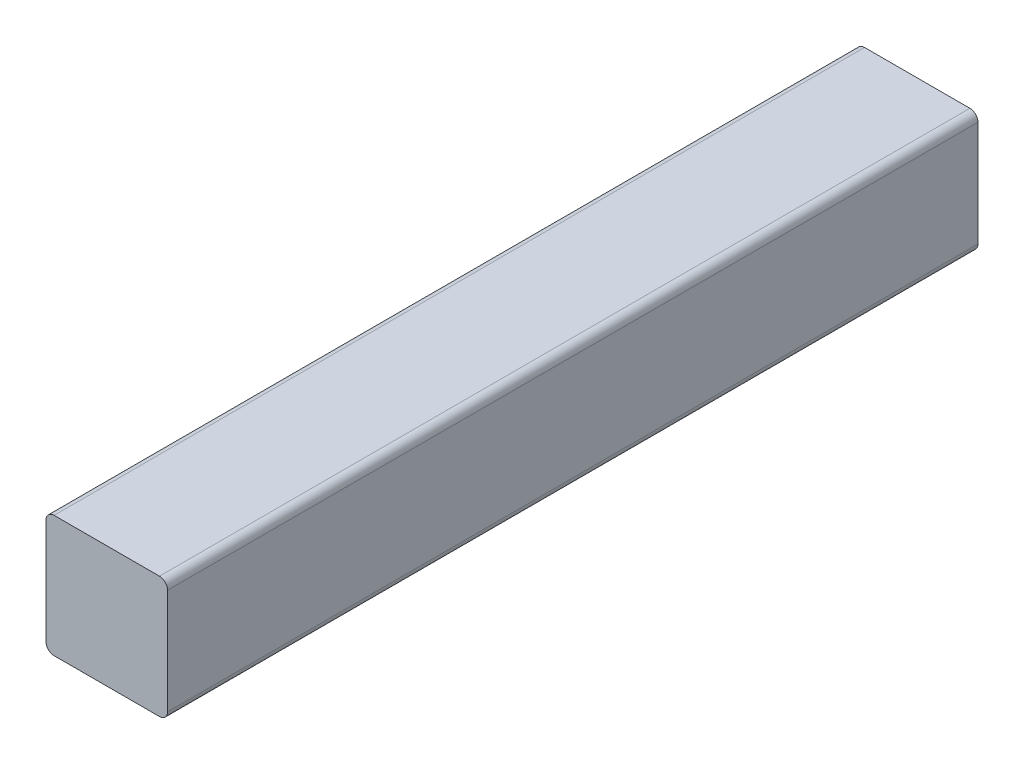
ISO-10303-21;
HEADER;
FILE_DESCRIPTION(('STEP AP214'),'2;1');
FILE_NAME('part.step','',(''),(''),'','','');
FILE_SCHEMA(('AUTOMOTIVE_DESIGN { 1 0 10303 214 1 1 1 1 }'));
ENDSEC;
DATA;
#1=APPLICATION_CONTEXT('core data for automotive mechanical design processes');
#2=APPLICATION_PROTOCOL_DEFINITION('international standard','automotive_design',2000,#1);
#3=PRODUCT_CONTEXT('',#1,'mechanical');
#4=PRODUCT('Part','Part','',(#3));
#5=PRODUCT_RELATED_PRODUCT_CATEGORY('part','',(#4));
#6=PRODUCT_DEFINITION_FORMATION('','',#4);
#7=PRODUCT_DEFINITION_CONTEXT('part definition',#1,'design');
#8=PRODUCT_DEFINITION('design','',#6,#7);
#9=PRODUCT_DEFINITION_SHAPE('','',#8);
#10=(LENGTH_UNIT() NAMED_UNIT(*) SI_UNIT(.MILLI.,.METRE.));
#11=(NAMED_UNIT(*) PLANE_ANGLE_UNIT() SI_UNIT($,.RADIAN.));
#12=(NAMED_UNIT(*) SI_UNIT($,.STERADIAN.) SOLID_ANGLE_UNIT());
#13=UNCERTAINTY_MEASURE_WITH_UNIT(LENGTH_MEASURE(1.E-05),#10,'distance_accuracy_value','');
#14=(GEOMETRIC_REPRESENTATION_CONTEXT(3) GLOBAL_UNCERTAINTY_ASSIGNED_CONTEXT((#13)) GLOBAL_UNIT_ASSIGNED_CONTEXT((#10,
#11,#12)) REPRESENTATION_CONTEXT('',''));
#15=CARTESIAN_POINT('',(0.,0.,0.));
#16=DIRECTION('',(0.,0.,1.));
#17=DIRECTION('',(1.,0.,0.));
#18=AXIS2_PLACEMENT_3D('',#15,#16,#17);
#19=CARTESIAN_POINT('',(2.,2.,200.));
#20=DIRECTION('',(0.,0.,-1.));
#21=DIRECTION('',(-1.,0.,0.));
#22=AXIS2_PLACEMENT_3D('',#19,#20,#21);
#23=CYLINDRICAL_SURFACE('',#22,2.);
#24=CARTESIAN_POINT('',(2.,2.,0.));
#25=DIRECTION('',(0.,0.,1.));
#26=DIRECTION('',(-1.,0.,0.));
#27=AXIS2_PLACEMENT_3D('',#24,#25,#26);
#28=CIRCLE('',#27,2.);
#29=CARTESIAN_POINT('',(0.,2.00000000000001,0.));
#30=VERTEX_POINT('',#29);
#31=CARTESIAN_POINT('',(2.00000000000001,0.,0.));
#32=VERTEX_POINT('',#31);
#33=EDGE_CURVE('E129',#30,#32,#28,.T.);
#34=ORIENTED_EDGE('',*,*,#33,.T.);
#35=DIRECTION('',(0.,0.,-1.));
#36=VECTOR('',#35,1.);
#37=CARTESIAN_POINT('',(2.00000000000001,0.,200.));
#38=LINE('',#37,#36);
#39=CARTESIAN_POINT('',(2.00000000000001,0.,200.));
#40=VERTEX_POINT('',#39);
#41=EDGE_CURVE('E11',#40,#32,#38,.T.);
#42=ORIENTED_EDGE('',*,*,#41,.F.);
#43=CARTESIAN_POINT('',(2.,2.,200.));
#44=DIRECTION('',(0.,0.,1.));
#45=DIRECTION('',(-1.,0.,0.));
#46=AXIS2_PLACEMENT_3D('',#43,#44,#45);
#47=CIRCLE('',#46,2.);
#48=CARTESIAN_POINT('',(0.,2.00000000000001,200.));
#49=VERTEX_POINT('',#48);
#50=EDGE_CURVE('E143',#49,#40,#47,.T.);
#51=ORIENTED_EDGE('',*,*,#50,.F.);
#52=DIRECTION('',(0.,0.,-1.));
#53=VECTOR('',#52,1.);
#54=CARTESIAN_POINT('',(0.,2.00000000000001,200.));
#55=LINE('',#54,#53);
#56=EDGE_CURVE('E125',#49,#30,#55,.T.);
#57=ORIENTED_EDGE('',*,*,#56,.T.);
#58=EDGE_LOOP('',(#34,#42,#51,#57));
#59=FACE_BOUND('',#58,.T.);
#60=ADVANCED_FACE('F33',(#59),#23,.T.);
#61=CARTESIAN_POINT('',(2.00000000000001,0.,200.));
#62=DIRECTION('',(0.,1.,0.));
#63=DIRECTION('',(0.,0.,1.));
#64=AXIS2_PLACEMENT_3D('',#61,#62,#63);
#65=PLANE('',#64);
#66=DIRECTION('',(1.,0.,0.));
#67=VECTOR('',#66,1.);
#68=CARTESIAN_POINT('',(2.00000000000001,0.,0.));
#69=LINE('',#68,#67);
#70=CARTESIAN_POINT('',(28.,0.,0.));
#71=VERTEX_POINT('',#70);
#72=EDGE_CURVE('E132',#32,#71,#69,.T.);
#73=ORIENTED_EDGE('',*,*,#72,.T.);
#74=DIRECTION('',(0.,0.,-1.));
#75=VECTOR('',#74,1.);
#76=CARTESIAN_POINT('',(28.,0.,200.));
#77=LINE('',#76,#75);
#78=CARTESIAN_POINT('',(28.,0.,200.));
#79=VERTEX_POINT('',#78);
#80=EDGE_CURVE('E41',#79,#71,#77,.T.);
#81=ORIENTED_EDGE('',*,*,#80,.F.);
#82=DIRECTION('',(1.,0.,0.));
#83=VECTOR('',#82,1.);
#84=CARTESIAN_POINT('',(2.00000000000001,0.,200.));
#85=LINE('',#84,#83);
#86=EDGE_CURVE('E92',#40,#79,#85,.T.);
#87=ORIENTED_EDGE('',*,*,#86,.F.);
#88=ORIENTED_EDGE('',*,*,#41,.T.);
#89=EDGE_LOOP('',(#73,#81,#87,#88));
#90=FACE_BOUND('',#89,.T.);
#91=ADVANCED_FACE('F178',(#90),#65,.F.);
#92=CARTESIAN_POINT('',(28.,2.,200.));
#93=DIRECTION('',(0.,0.,-1.));
#94=DIRECTION('',(-1.,0.,0.));
#95=AXIS2_PLACEMENT_3D('',#92,#93,#94);
#96=CYLINDRICAL_SURFACE('',#95,2.);
#97=CARTESIAN_POINT('',(28.,2.,0.));
#98=DIRECTION('',(0.,0.,1.));
#99=DIRECTION('',(-1.,0.,0.));
#100=AXIS2_PLACEMENT_3D('',#97,#98,#99);
#101=CIRCLE('',#100,2.);
#102=CARTESIAN_POINT('',(30.,2.00000000000001,0.));
#103=VERTEX_POINT('',#102);
#104=EDGE_CURVE('E134',#71,#103,#101,.T.);
#105=ORIENTED_EDGE('',*,*,#104,.T.);
#106=DIRECTION('',(0.,0.,-1.));
#107=VECTOR('',#106,1.);
#108=CARTESIAN_POINT('',(30.,2.00000000000001,200.));
#109=LINE('',#108,#107);
#110=CARTESIAN_POINT('',(30.,2.00000000000001,200.));
#111=VERTEX_POINT('',#110);
#112=EDGE_CURVE('E150',#111,#103,#109,.T.);
#113=ORIENTED_EDGE('',*,*,#112,.F.);
#114=CARTESIAN_POINT('',(28.,2.,200.));
#115=DIRECTION('',(0.,0.,1.));
#116=DIRECTION('',(-1.,0.,0.));
#117=AXIS2_PLACEMENT_3D('',#114,#115,#116);
#118=CIRCLE('',#117,2.);
#119=EDGE_CURVE('E158',#79,#111,#118,.T.);
#120=ORIENTED_EDGE('',*,*,#119,.F.);
#121=ORIENTED_EDGE('',*,*,#80,.T.);
#122=EDGE_LOOP('',(#105,#113,#120,#121));
#123=FACE_BOUND('',#122,.T.);
#124=ADVANCED_FACE('F156',(#123),#96,.T.);
#125=CARTESIAN_POINT('',(30.,2.00000000000001,200.));
#126=DIRECTION('',(-1.,0.,0.));
#127=DIRECTION('',(0.,0.,1.));
#128=AXIS2_PLACEMENT_3D('',#125,#126,#127);
#129=PLANE('',#128);
#130=DIRECTION('',(0.,1.,0.));
#131=VECTOR('',#130,1.);
#132=CARTESIAN_POINT('',(30.,2.00000000000001,0.));
#133=LINE('',#132,#131);
#134=CARTESIAN_POINT('',(30.,28.,0.));
#135=VERTEX_POINT('',#134);
#136=EDGE_CURVE('E136',#103,#135,#133,.T.);
#137=ORIENTED_EDGE('',*,*,#136,.T.);
#138=DIRECTION('',(0.,0.,-1.));
#139=VECTOR('',#138,1.);
#140=CARTESIAN_POINT('',(30.,28.,200.));
#141=LINE('',#140,#139);
#142=CARTESIAN_POINT('',(30.,28.,200.));
#143=VERTEX_POINT('',#142);
#144=EDGE_CURVE('E147',#143,#135,#141,.T.);
#145=ORIENTED_EDGE('',*,*,#144,.F.);
#146=DIRECTION('',(0.,1.,0.));
#147=VECTOR('',#146,1.);
#148=CARTESIAN_POINT('',(30.,2.00000000000001,200.));
#149=LINE('',#148,#147);
#150=EDGE_CURVE('E170',#111,#143,#149,.T.);
#151=ORIENTED_EDGE('',*,*,#150,.F.);
#152=ORIENTED_EDGE('',*,*,#112,.T.);
#153=EDGE_LOOP('',(#137,#145,#151,#152));
#154=FACE_BOUND('',#153,.T.);
#155=ADVANCED_FACE('F166',(#154),#129,.F.);
#156=CARTESIAN_POINT('',(28.,28.,200.));
#157=DIRECTION('',(0.,0.,-1.));
#158=DIRECTION('',(-1.,0.,0.));
#159=AXIS2_PLACEMENT_3D('',#156,#157,#158);
#160=CYLINDRICAL_SURFACE('',#159,2.);
#161=CARTESIAN_POINT('',(28.,28.,0.));
#162=DIRECTION('',(0.,0.,1.));
#163=DIRECTION('',(-1.,0.,0.));
#164=AXIS2_PLACEMENT_3D('',#161,#162,#163);
#165=CIRCLE('',#164,2.);
#166=CARTESIAN_POINT('',(28.,30.,0.));
#167=VERTEX_POINT('',#166);
#168=EDGE_CURVE('E138',#135,#167,#165,.T.);
#169=ORIENTED_EDGE('',*,*,#168,.T.);
#170=DIRECTION('',(0.,0.,-1.));
#171=VECTOR('',#170,1.);
#172=CARTESIAN_POINT('',(28.,30.,200.));
#173=LINE('',#172,#171);
#174=CARTESIAN_POINT('',(28.,30.,200.));
#175=VERTEX_POINT('',#174);
#176=EDGE_CURVE('E120',#175,#167,#173,.T.);
#177=ORIENTED_EDGE('',*,*,#176,.F.);
#178=CARTESIAN_POINT('',(28.,28.,200.));
#179=DIRECTION('',(0.,0.,1.));
#180=DIRECTION('',(-1.,0.,0.));
#181=AXIS2_PLACEMENT_3D('',#178,#179,#180);
#182=CIRCLE('',#181,2.);
#183=EDGE_CURVE('E111',#143,#175,#182,.T.);
#184=ORIENTED_EDGE('',*,*,#183,.F.);
#185=ORIENTED_EDGE('',*,*,#144,.T.);
#186=EDGE_LOOP('',(#169,#177,#184,#185));
#187=FACE_BOUND('',#186,.T.);
#188=ADVANCED_FACE('F169',(#187),#160,.T.);
#189=CARTESIAN_POINT('',(28.,30.,200.));
#190=DIRECTION('',(0.,-1.,0.));
#191=DIRECTION('',(0.,0.,-1.));
#192=AXIS2_PLACEMENT_3D('',#189,#190,#191);
#193=PLANE('',#192);
#194=DIRECTION('',(-1.,0.,0.));
#195=VECTOR('',#194,1.);
#196=CARTESIAN_POINT('',(28.,30.,0.));
#197=LINE('',#196,#195);
#198=CARTESIAN_POINT('',(2.00000000000001,30.,0.));
#199=VERTEX_POINT('',#198);
#200=EDGE_CURVE('E119',#167,#199,#197,.T.);
#201=ORIENTED_EDGE('',*,*,#200,.T.);
#202=DIRECTION('',(0.,0.,-1.));
#203=VECTOR('',#202,1.);
#204=CARTESIAN_POINT('',(2.00000000000001,30.,200.));
#205=LINE('',#204,#203);
#206=CARTESIAN_POINT('',(2.00000000000001,30.,200.));
#207=VERTEX_POINT('',#206);
#208=EDGE_CURVE('E116',#207,#199,#205,.T.);
#209=ORIENTED_EDGE('',*,*,#208,.F.);
#210=DIRECTION('',(-1.,0.,0.));
#211=VECTOR('',#210,1.);
#212=CARTESIAN_POINT('',(28.,30.,200.));
#213=LINE('',#212,#211);
#214=EDGE_CURVE('E105',#175,#207,#213,.T.);
#215=ORIENTED_EDGE('',*,*,#214,.F.);
#216=ORIENTED_EDGE('',*,*,#176,.T.);
#217=EDGE_LOOP('',(#201,#209,#215,#216));
#218=FACE_BOUND('',#217,.T.);
#219=ADVANCED_FACE('F117',(#218),#193,.F.);
#220=CARTESIAN_POINT('',(2.,28.,200.));
#221=DIRECTION('',(0.,0.,-1.));
#222=DIRECTION('',(-1.,0.,0.));
#223=AXIS2_PLACEMENT_3D('',#220,#221,#222);
#224=CYLINDRICAL_SURFACE('',#223,2.);
#225=CARTESIAN_POINT('',(2.,28.,0.));
#226=DIRECTION('',(0.,0.,1.));
#227=DIRECTION('',(-1.,0.,0.));
#228=AXIS2_PLACEMENT_3D('',#225,#226,#227);
#229=CIRCLE('',#228,2.);
#230=CARTESIAN_POINT('',(0.,28.,0.));
#231=VERTEX_POINT('',#230);
#232=EDGE_CURVE('E78',#199,#231,#229,.T.);
#233=ORIENTED_EDGE('',*,*,#232,.T.);
#234=DIRECTION('',(0.,0.,-1.));
#235=VECTOR('',#234,1.);
#236=CARTESIAN_POINT('',(0.,28.,200.));
#237=LINE('',#236,#235);
#238=CARTESIAN_POINT('',(0.,28.,200.));
#239=VERTEX_POINT('',#238);
#240=EDGE_CURVE('E121',#239,#231,#237,.T.);
#241=ORIENTED_EDGE('',*,*,#240,.F.);
#242=CARTESIAN_POINT('',(2.,28.,200.));
#243=DIRECTION('',(0.,0.,1.));
#244=DIRECTION('',(-1.,0.,0.));
#245=AXIS2_PLACEMENT_3D('',#242,#243,#244);
#246=CIRCLE('',#245,2.);
#247=EDGE_CURVE('E109',#207,#239,#246,.T.);
#248=ORIENTED_EDGE('',*,*,#247,.F.);
#249=ORIENTED_EDGE('',*,*,#208,.T.);
#250=EDGE_LOOP('',(#233,#241,#248,#249));
#251=FACE_BOUND('',#250,.T.);
#252=ADVANCED_FACE('F123',(#251),#224,.T.);
#253=CARTESIAN_POINT('',(0.,28.,200.));
#254=DIRECTION('',(1.,0.,0.));
#255=DIRECTION('',(0.,0.,-1.));
#256=AXIS2_PLACEMENT_3D('',#253,#254,#255);
#257=PLANE('',#256);
#258=DIRECTION('',(0.,-1.,0.));
#259=VECTOR('',#258,1.);
#260=CARTESIAN_POINT('',(0.,28.,0.));
#261=LINE('',#260,#259);
#262=EDGE_CURVE('E84',#231,#30,#261,.T.);
#263=ORIENTED_EDGE('',*,*,#262,.T.);
#264=ORIENTED_EDGE('',*,*,#56,.F.);
#265=DIRECTION('',(0.,-1.,0.));
#266=VECTOR('',#265,1.);
#267=CARTESIAN_POINT('',(0.,28.,200.));
#268=LINE('',#267,#266);
#269=EDGE_CURVE('E49',#239,#49,#268,.T.);
#270=ORIENTED_EDGE('',*,*,#269,.F.);
#271=ORIENTED_EDGE('',*,*,#240,.T.);
#272=EDGE_LOOP('',(#263,#264,#270,#271));
#273=FACE_BOUND('',#272,.T.);
#274=ADVANCED_FACE('F194',(#273),#257,.F.);
#275=CARTESIAN_POINT('',(2.,2.,200.));
#276=DIRECTION('',(0.,0.,-1.));
#277=DIRECTION('',(-1.,0.,0.));
#278=AXIS2_PLACEMENT_3D('',#275,#276,#277);
#279=PLANE('',#278);
#280=ORIENTED_EDGE('',*,*,#50,.T.);
#281=ORIENTED_EDGE('',*,*,#86,.T.);
#282=ORIENTED_EDGE('',*,*,#119,.T.);
#283=ORIENTED_EDGE('',*,*,#150,.T.);
#284=ORIENTED_EDGE('',*,*,#183,.T.);
#285=ORIENTED_EDGE('',*,*,#214,.T.);
#286=ORIENTED_EDGE('',*,*,#247,.T.);
#287=ORIENTED_EDGE('',*,*,#269,.T.);
#288=EDGE_LOOP('',(#280,#281,#282,#283,#284,#285,#286,#287));
#289=FACE_BOUND('',#288,.T.);
#290=ADVANCED_FACE('F107',(#289),#279,.F.);
#291=CARTESIAN_POINT('',(2.,2.,0.));
#292=DIRECTION('',(0.,0.,-1.));
#293=DIRECTION('',(-1.,0.,0.));
#294=AXIS2_PLACEMENT_3D('',#291,#292,#293);
#295=PLANE('',#294);
#296=ORIENTED_EDGE('',*,*,#33,.F.);
#297=ORIENTED_EDGE('',*,*,#262,.F.);
#298=ORIENTED_EDGE('',*,*,#232,.F.);
#299=ORIENTED_EDGE('',*,*,#200,.F.);
#300=ORIENTED_EDGE('',*,*,#168,.F.);
#301=ORIENTED_EDGE('',*,*,#136,.F.);
#302=ORIENTED_EDGE('',*,*,#104,.F.);
#303=ORIENTED_EDGE('',*,*,#72,.F.);
#304=EDGE_LOOP('',(#296,#297,#298,#299,#300,#301,#302,#303));
#305=FACE_BOUND('',#304,.T.);
#306=ADVANCED_FACE('F162',(#305),#295,.T.);
#307=CLOSED_SHELL('',(#60,#91,#124,#155,#188,#219,#252,#274,#290,#306));
#308=MANIFOLD_SOLID_BREP('B2',#307);
#309=ADVANCED_BREP_SHAPE_REPRESENTATION('',(#18,#308),#14);
#310=SHAPE_DEFINITION_REPRESENTATION(#9,#309);
ENDSEC;
END-ISO-10303-21;
